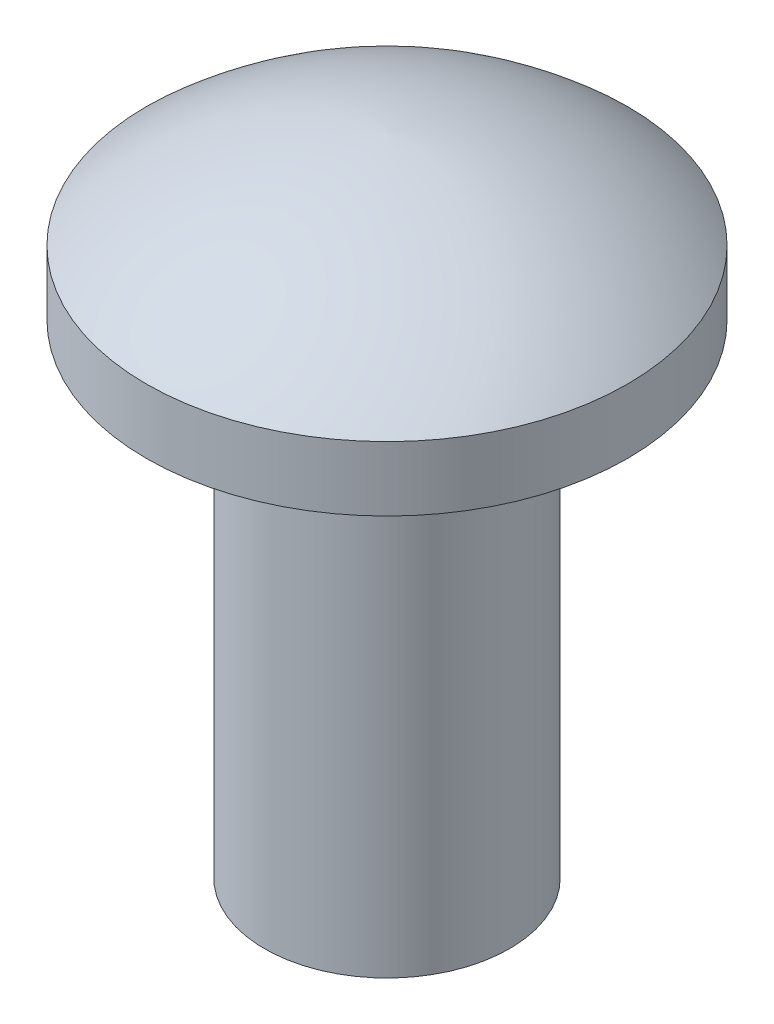
ISO-10303-21;
HEADER;
FILE_DESCRIPTION(('STEP AP214'),'2;1');
FILE_NAME('part.step','',(''),(''),'','','');
FILE_SCHEMA(('AUTOMOTIVE_DESIGN { 1 0 10303 214 1 1 1 1 }'));
ENDSEC;
DATA;
#1=APPLICATION_CONTEXT('core data for automotive mechanical design processes');
#2=APPLICATION_PROTOCOL_DEFINITION('international standard','automotive_design',2000,#1);
#3=PRODUCT_CONTEXT('',#1,'mechanical');
#4=PRODUCT('Part','Part','',(#3));
#5=PRODUCT_RELATED_PRODUCT_CATEGORY('part','',(#4));
#6=PRODUCT_DEFINITION_FORMATION('','',#4);
#7=PRODUCT_DEFINITION_CONTEXT('part definition',#1,'design');
#8=PRODUCT_DEFINITION('design','',#6,#7);
#9=PRODUCT_DEFINITION_SHAPE('','',#8);
#10=(LENGTH_UNIT() NAMED_UNIT(*) SI_UNIT(.MILLI.,.METRE.));
#11=(NAMED_UNIT(*) PLANE_ANGLE_UNIT() SI_UNIT($,.RADIAN.));
#12=(NAMED_UNIT(*) SI_UNIT($,.STERADIAN.) SOLID_ANGLE_UNIT());
#13=UNCERTAINTY_MEASURE_WITH_UNIT(LENGTH_MEASURE(1.E-05),#10,'distance_accuracy_value','');
#14=(GEOMETRIC_REPRESENTATION_CONTEXT(3) GLOBAL_UNCERTAINTY_ASSIGNED_CONTEXT((#13)) GLOBAL_UNIT_ASSIGNED_CONTEXT((#10,
#11,#12)) REPRESENTATION_CONTEXT('',''));
#15=CARTESIAN_POINT('',(0.,0.,0.));
#16=DIRECTION('',(0.,0.,1.));
#17=DIRECTION('',(1.,0.,0.));
#18=AXIS2_PLACEMENT_3D('',#15,#16,#17);
#19=CARTESIAN_POINT('',(0.,0.,0.));
#20=DIRECTION('',(0.,-1.,0.));
#21=DIRECTION('',(0.,0.,-1.));
#22=AXIS2_PLACEMENT_3D('',#19,#20,#21);
#23=PLANE('',#22);
#24=CARTESIAN_POINT('',(0.,0.,0.));
#25=DIRECTION('',(0.,-1.,0.));
#26=DIRECTION('',(0.,0.,-1.));
#27=AXIS2_PLACEMENT_3D('',#24,#25,#26);
#28=CIRCLE('',#27,2.413);
#29=CARTESIAN_POINT('',(0.,0.,-2.413));
#30=VERTEX_POINT('',#29);
#31=EDGE_CURVE('E61',#30,#30,#28,.T.);
#32=ORIENTED_EDGE('',*,*,#31,.T.);
#33=EDGE_LOOP('',(#32));
#34=FACE_BOUND('',#33,.T.);
#35=ADVANCED_FACE('F37',(#34),#23,.T.);
#36=CARTESIAN_POINT('',(0.,4.98635494742528,0.350409136424148));
#37=DIRECTION('',(-1.,0.,0.));
#38=DIRECTION('',(0.,0.,-1.));
#39=AXIS2_PLACEMENT_3D('',#36,#37,#38);
#40=CIRCLE('',#39,7.7216);
#41=TRIMMED_CURVE('',#40,(PARAMETER_VALUE(-1.52540035719307)),
(PARAMETER_VALUE(1.52540035719307)),.T.,.PARAMETER.);
#42=CARTESIAN_POINT('',(0.,4.98635494742528,0.));
#43=DIRECTION('',(0.,-1.,0.));
#44=AXIS1_PLACEMENT('',#42,#43);
#45=SURFACE_OF_REVOLUTION('',#41,#44);
#46=CARTESIAN_POINT('',(0.,12.7,0.));
#47=VERTEX_POINT('',#46);
#48=VERTEX_LOOP('',#47);
#49=FACE_BOUND('',#48,.T.);
#50=CARTESIAN_POINT('',(0.,10.795,0.));
#51=DIRECTION('',(0.,-1.,0.));
#52=DIRECTION('',(0.,0.,-1.));
#53=AXIS2_PLACEMENT_3D('',#50,#51,#52);
#54=CIRCLE('',#53,4.7371);
#55=CARTESIAN_POINT('',(0.,10.795,-4.7371));
#56=VERTEX_POINT('',#55);
#57=EDGE_CURVE('E11',#56,#56,#54,.T.);
#58=ORIENTED_EDGE('',*,*,#57,.F.);
#59=EDGE_LOOP('',(#58));
#60=FACE_BOUND('',#59,.T.);
#61=ADVANCED_FACE('F46',(#49,#60),#45,.T.);
#62=CARTESIAN_POINT('',(0.,0.,0.));
#63=DIRECTION('',(0.,-1.,0.));
#64=DIRECTION('',(0.,0.,-1.));
#65=AXIS2_PLACEMENT_3D('',#62,#63,#64);
#66=CYLINDRICAL_SURFACE('',#65,4.7371);
#67=ORIENTED_EDGE('',*,*,#57,.T.);
#68=EDGE_LOOP('',(#67));
#69=FACE_BOUND('',#68,.T.);
#70=CARTESIAN_POINT('',(0.,9.525,0.));
#71=DIRECTION('',(0.,-1.,0.));
#72=DIRECTION('',(0.,0.,-1.));
#73=AXIS2_PLACEMENT_3D('',#70,#71,#72);
#74=CIRCLE('',#73,4.7371);
#75=CARTESIAN_POINT('',(0.,9.525,-4.7371));
#76=VERTEX_POINT('',#75);
#77=EDGE_CURVE('E43',#76,#76,#74,.T.);
#78=ORIENTED_EDGE('',*,*,#77,.F.);
#79=EDGE_LOOP('',(#78));
#80=FACE_BOUND('',#79,.T.);
#81=ADVANCED_FACE('F49',(#69,#80),#66,.T.);
#82=CARTESIAN_POINT('',(2.413,9.525,0.));
#83=DIRECTION('',(0.,-1.,0.));
#84=DIRECTION('',(0.,0.,-1.));
#85=AXIS2_PLACEMENT_3D('',#82,#83,#84);
#86=PLANE('',#85);
#87=ORIENTED_EDGE('',*,*,#77,.T.);
#88=EDGE_LOOP('',(#87));
#89=FACE_BOUND('',#88,.T.);
#90=CARTESIAN_POINT('',(0.,9.525,0.));
#91=DIRECTION('',(0.,-1.,0.));
#92=DIRECTION('',(0.,0.,-1.));
#93=AXIS2_PLACEMENT_3D('',#90,#91,#92);
#94=CIRCLE('',#93,2.413);
#95=CARTESIAN_POINT('',(0.,9.525,-2.413));
#96=VERTEX_POINT('',#95);
#97=EDGE_CURVE('E59',#96,#96,#94,.T.);
#98=ORIENTED_EDGE('',*,*,#97,.F.);
#99=EDGE_LOOP('',(#98));
#100=FACE_BOUND('',#99,.T.);
#101=ADVANCED_FACE('F54',(#89,#100),#86,.T.);
#102=CARTESIAN_POINT('',(0.,0.,0.));
#103=DIRECTION('',(0.,-1.,0.));
#104=DIRECTION('',(0.,0.,-1.));
#105=AXIS2_PLACEMENT_3D('',#102,#103,#104);
#106=CYLINDRICAL_SURFACE('',#105,2.413);
#107=ORIENTED_EDGE('',*,*,#97,.T.);
#108=EDGE_LOOP('',(#107));
#109=FACE_BOUND('',#108,.T.);
#110=ORIENTED_EDGE('',*,*,#31,.F.);
#111=EDGE_LOOP('',(#110));
#112=FACE_BOUND('',#111,.T.);
#113=ADVANCED_FACE('F68',(#109,#112),#106,.T.);
#114=CLOSED_SHELL('',(#35,#61,#81,#101,#113));
#115=MANIFOLD_SOLID_BREP('B2',#114);
#116=ADVANCED_BREP_SHAPE_REPRESENTATION('',(#18,#115),#14);
#117=SHAPE_DEFINITION_REPRESENTATION(#9,#116);
ENDSEC;
END-ISO-10303-21;
